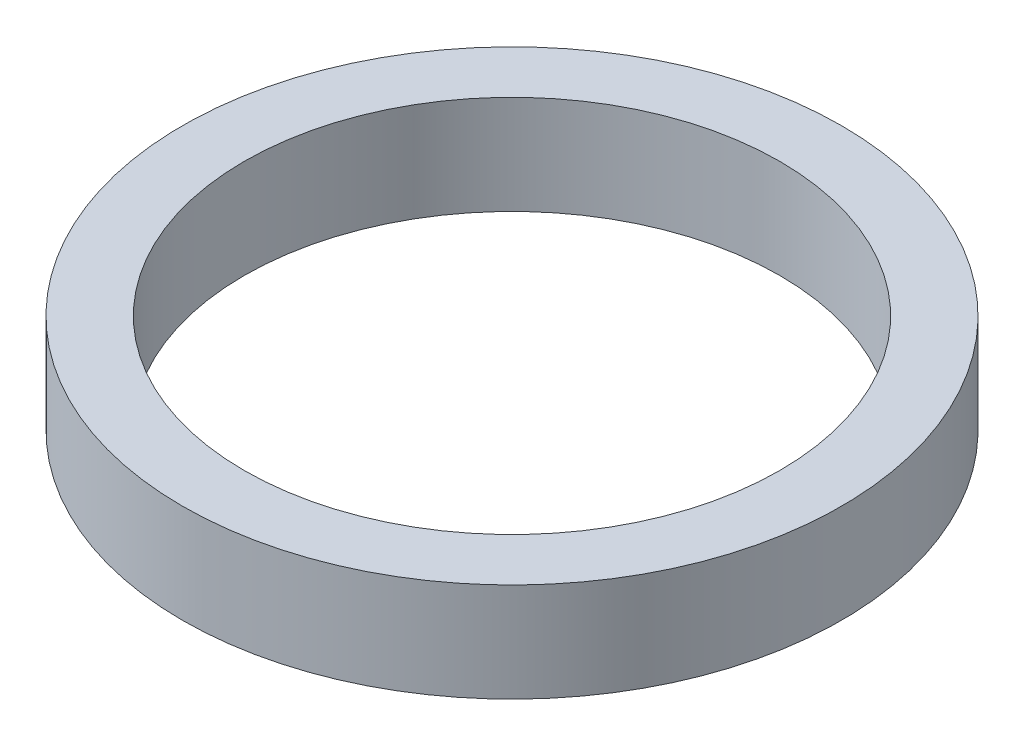
ISO-10303-21;
HEADER;
FILE_DESCRIPTION(('STEP AP214'),'2;1');
FILE_NAME('part.step','',(''),(''),'','','');
FILE_SCHEMA(('AUTOMOTIVE_DESIGN { 1 0 10303 214 1 1 1 1 }'));
ENDSEC;
DATA;
#1=APPLICATION_CONTEXT('core data for automotive mechanical design processes');
#2=APPLICATION_PROTOCOL_DEFINITION('international standard','automotive_design',2000,#1);
#3=PRODUCT_CONTEXT('',#1,'mechanical');
#4=PRODUCT('Part','Part','',(#3));
#5=PRODUCT_RELATED_PRODUCT_CATEGORY('part','',(#4));
#6=PRODUCT_DEFINITION_FORMATION('','',#4);
#7=PRODUCT_DEFINITION_CONTEXT('part definition',#1,'design');
#8=PRODUCT_DEFINITION('design','',#6,#7);
#9=PRODUCT_DEFINITION_SHAPE('','',#8);
#10=(LENGTH_UNIT() NAMED_UNIT(*) SI_UNIT(.MILLI.,.METRE.));
#11=(NAMED_UNIT(*) PLANE_ANGLE_UNIT() SI_UNIT($,.RADIAN.));
#12=(NAMED_UNIT(*) SI_UNIT($,.STERADIAN.) SOLID_ANGLE_UNIT());
#13=UNCERTAINTY_MEASURE_WITH_UNIT(LENGTH_MEASURE(1.E-05),#10,'distance_accuracy_value','');
#14=(GEOMETRIC_REPRESENTATION_CONTEXT(3) GLOBAL_UNCERTAINTY_ASSIGNED_CONTEXT((#13)) GLOBAL_UNIT_ASSIGNED_CONTEXT((#10,
#11,#12)) REPRESENTATION_CONTEXT('',''));
#15=CARTESIAN_POINT('',(0.,0.,0.));
#16=DIRECTION('',(0.,0.,1.));
#17=DIRECTION('',(1.,0.,0.));
#18=AXIS2_PLACEMENT_3D('',#15,#16,#17);
#19=CARTESIAN_POINT('',(0.,12.,0.));
#20=DIRECTION('',(0.,-1.,0.));
#21=DIRECTION('',(0.,0.,-1.));
#22=AXIS2_PLACEMENT_3D('',#19,#20,#21);
#23=CYLINDRICAL_SURFACE('',#22,40.);
#24=CARTESIAN_POINT('',(0.,12.,0.));
#25=DIRECTION('',(0.,1.,0.));
#26=DIRECTION('',(0.,0.,1.));
#27=AXIS2_PLACEMENT_3D('',#24,#25,#26);
#28=CIRCLE('',#27,40.);
#29=CARTESIAN_POINT('',(0.,12.,40.));
#30=VERTEX_POINT('',#29);
#31=EDGE_CURVE('E10',#30,#30,#28,.T.);
#32=ORIENTED_EDGE('',*,*,#31,.F.);
#33=EDGE_LOOP('',(#32));
#34=FACE_BOUND('',#33,.T.);
#35=CARTESIAN_POINT('',(0.,0.,0.));
#36=DIRECTION('',(0.,1.,0.));
#37=DIRECTION('',(0.,0.,1.));
#38=AXIS2_PLACEMENT_3D('',#35,#36,#37);
#39=CIRCLE('',#38,40.);
#40=CARTESIAN_POINT('',(0.,0.,40.));
#41=VERTEX_POINT('',#40);
#42=EDGE_CURVE('E37',#41,#41,#39,.T.);
#43=ORIENTED_EDGE('',*,*,#42,.T.);
#44=EDGE_LOOP('',(#43));
#45=FACE_BOUND('',#44,.T.);
#46=ADVANCED_FACE('F40',(#34,#45),#23,.T.);
#47=CARTESIAN_POINT('',(0.,12.,0.));
#48=DIRECTION('',(0.,1.,0.));
#49=DIRECTION('',(0.,0.,1.));
#50=AXIS2_PLACEMENT_3D('',#47,#48,#49);
#51=PLANE('',#50);
#52=CARTESIAN_POINT('',(0.,12.,0.));
#53=DIRECTION('',(0.,1.,0.));
#54=DIRECTION('',(0.,0.,1.));
#55=AXIS2_PLACEMENT_3D('',#52,#53,#54);
#56=CIRCLE('',#55,32.5);
#57=CARTESIAN_POINT('',(0.,12.,32.5));
#58=VERTEX_POINT('',#57);
#59=EDGE_CURVE('E50',#58,#58,#56,.T.);
#60=ORIENTED_EDGE('',*,*,#59,.F.);
#61=EDGE_LOOP('',(#60));
#62=FACE_BOUND('',#61,.T.);
#63=ORIENTED_EDGE('',*,*,#31,.T.);
#64=EDGE_LOOP('',(#63));
#65=FACE_BOUND('',#64,.T.);
#66=ADVANCED_FACE('F59',(#62,#65),#51,.T.);
#67=CARTESIAN_POINT('',(0.,0.,0.));
#68=DIRECTION('',(0.,1.,0.));
#69=DIRECTION('',(0.,0.,1.));
#70=AXIS2_PLACEMENT_3D('',#67,#68,#69);
#71=PLANE('',#70);
#72=CARTESIAN_POINT('',(0.,0.,0.));
#73=DIRECTION('',(0.,1.,0.));
#74=DIRECTION('',(0.,0.,1.));
#75=AXIS2_PLACEMENT_3D('',#72,#73,#74);
#76=CIRCLE('',#75,32.5);
#77=CARTESIAN_POINT('',(0.,0.,32.5));
#78=VERTEX_POINT('',#77);
#79=EDGE_CURVE('E47',#78,#78,#76,.T.);
#80=ORIENTED_EDGE('',*,*,#79,.T.);
#81=EDGE_LOOP('',(#80));
#82=FACE_BOUND('',#81,.T.);
#83=ORIENTED_EDGE('',*,*,#42,.F.);
#84=EDGE_LOOP('',(#83));
#85=FACE_BOUND('',#84,.T.);
#86=ADVANCED_FACE('F58',(#82,#85),#71,.F.);
#87=CARTESIAN_POINT('',(0.,12.,0.));
#88=DIRECTION('',(0.,-1.,0.));
#89=DIRECTION('',(0.,0.,-1.));
#90=AXIS2_PLACEMENT_3D('',#87,#88,#89);
#91=CYLINDRICAL_SURFACE('',#90,32.5);
#92=ORIENTED_EDGE('',*,*,#59,.T.);
#93=EDGE_LOOP('',(#92));
#94=FACE_BOUND('',#93,.T.);
#95=ORIENTED_EDGE('',*,*,#79,.F.);
#96=EDGE_LOOP('',(#95));
#97=FACE_BOUND('',#96,.T.);
#98=ADVANCED_FACE('F54',(#94,#97),#91,.F.);
#99=CLOSED_SHELL('',(#46,#66,#86,#98));
#100=MANIFOLD_SOLID_BREP('B2',#99);
#101=ADVANCED_BREP_SHAPE_REPRESENTATION('',(#18,#100),#14);
#102=SHAPE_DEFINITION_REPRESENTATION(#9,#101);
ENDSEC;
END-ISO-10303-21;
